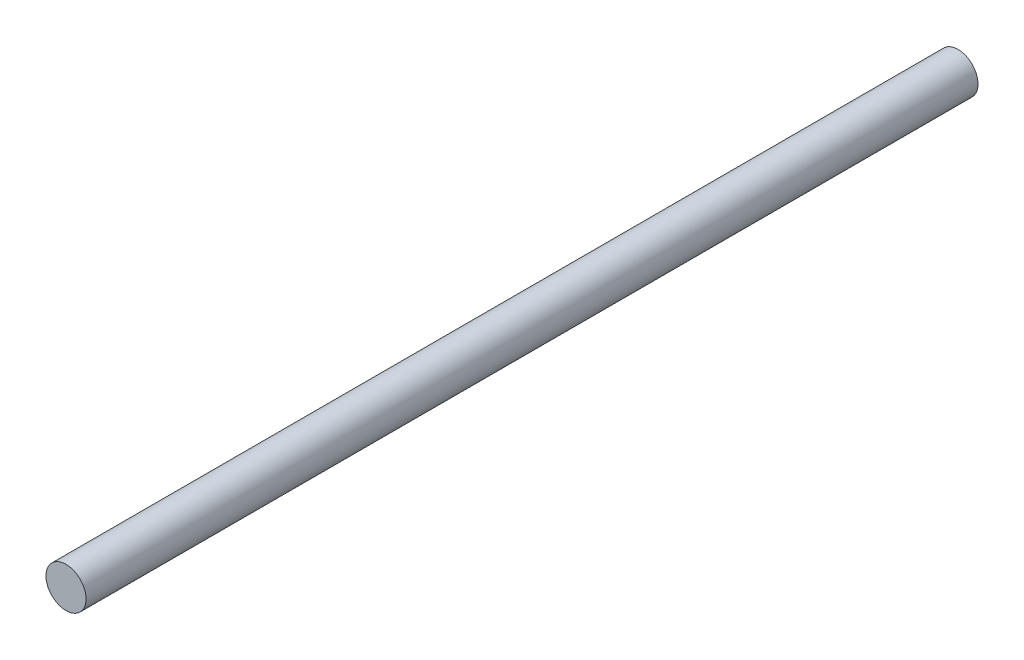
ISO-10303-21;
HEADER;
FILE_DESCRIPTION(('STEP AP214'),'2;1');
FILE_NAME('part.step','',(''),(''),'','','');
FILE_SCHEMA(('AUTOMOTIVE_DESIGN { 1 0 10303 214 1 1 1 1 }'));
ENDSEC;
DATA;
#1=APPLICATION_CONTEXT('core data for automotive mechanical design processes');
#2=APPLICATION_PROTOCOL_DEFINITION('international standard','automotive_design',2000,#1);
#3=PRODUCT_CONTEXT('',#1,'mechanical');
#4=PRODUCT('Part','Part','',(#3));
#5=PRODUCT_RELATED_PRODUCT_CATEGORY('part','',(#4));
#6=PRODUCT_DEFINITION_FORMATION('','',#4);
#7=PRODUCT_DEFINITION_CONTEXT('part definition',#1,'design');
#8=PRODUCT_DEFINITION('design','',#6,#7);
#9=PRODUCT_DEFINITION_SHAPE('','',#8);
#10=(LENGTH_UNIT() NAMED_UNIT(*) SI_UNIT(.MILLI.,.METRE.));
#11=(NAMED_UNIT(*) PLANE_ANGLE_UNIT() SI_UNIT($,.RADIAN.));
#12=(NAMED_UNIT(*) SI_UNIT($,.STERADIAN.) SOLID_ANGLE_UNIT());
#13=UNCERTAINTY_MEASURE_WITH_UNIT(LENGTH_MEASURE(1.E-05),#10,'distance_accuracy_value','');
#14=(GEOMETRIC_REPRESENTATION_CONTEXT(3) GLOBAL_UNCERTAINTY_ASSIGNED_CONTEXT((#13)) GLOBAL_UNIT_ASSIGNED_CONTEXT((#10,
#11,#12)) REPRESENTATION_CONTEXT('',''));
#15=CARTESIAN_POINT('',(0.,0.,0.));
#16=DIRECTION('',(0.,0.,1.));
#17=DIRECTION('',(1.,0.,0.));
#18=AXIS2_PLACEMENT_3D('',#15,#16,#17);
#19=CARTESIAN_POINT('',(0.,0.,66.76));
#20=DIRECTION('',(0.,0.,-1.));
#21=DIRECTION('',(-1.,0.,0.));
#22=AXIS2_PLACEMENT_3D('',#19,#20,#21);
#23=CYLINDRICAL_SURFACE('',#22,1.5);
#24=CARTESIAN_POINT('',(0.,0.,66.76));
#25=DIRECTION('',(0.,0.,1.));
#26=DIRECTION('',(1.,0.,0.));
#27=AXIS2_PLACEMENT_3D('',#24,#25,#26);
#28=CIRCLE('',#27,1.5);
#29=CARTESIAN_POINT('',(1.5,0.,66.76));
#30=VERTEX_POINT('',#29);
#31=EDGE_CURVE('E10',#30,#30,#28,.T.);
#32=ORIENTED_EDGE('',*,*,#31,.F.);
#33=EDGE_LOOP('',(#32));
#34=FACE_BOUND('',#33,.T.);
#35=CARTESIAN_POINT('',(0.,0.,0.));
#36=DIRECTION('',(0.,0.,1.));
#37=DIRECTION('',(1.,0.,0.));
#38=AXIS2_PLACEMENT_3D('',#35,#36,#37);
#39=CIRCLE('',#38,1.5);
#40=CARTESIAN_POINT('',(1.5,0.,0.));
#41=VERTEX_POINT('',#40);
#42=EDGE_CURVE('E17',#41,#41,#39,.T.);
#43=ORIENTED_EDGE('',*,*,#42,.T.);
#44=EDGE_LOOP('',(#43));
#45=FACE_BOUND('',#44,.T.);
#46=ADVANCED_FACE('F14',(#34,#45),#23,.T.);
#47=CARTESIAN_POINT('',(0.,0.,66.76));
#48=DIRECTION('',(0.,0.,1.));
#49=DIRECTION('',(1.,0.,0.));
#50=AXIS2_PLACEMENT_3D('',#47,#48,#49);
#51=PLANE('',#50);
#52=ORIENTED_EDGE('',*,*,#31,.T.);
#53=EDGE_LOOP('',(#52));
#54=FACE_BOUND('',#53,.T.);
#55=ADVANCED_FACE('F29',(#54),#51,.T.);
#56=CARTESIAN_POINT('',(0.,0.,0.));
#57=DIRECTION('',(0.,0.,1.));
#58=DIRECTION('',(1.,0.,0.));
#59=AXIS2_PLACEMENT_3D('',#56,#57,#58);
#60=PLANE('',#59);
#61=ORIENTED_EDGE('',*,*,#42,.F.);
#62=EDGE_LOOP('',(#61));
#63=FACE_BOUND('',#62,.T.);
#64=ADVANCED_FACE('F27',(#63),#60,.F.);
#65=CLOSED_SHELL('',(#46,#55,#64));
#66=MANIFOLD_SOLID_BREP('B1',#65);
#67=ADVANCED_BREP_SHAPE_REPRESENTATION('',(#18,#66),#14);
#68=SHAPE_DEFINITION_REPRESENTATION(#9,#67);
ENDSEC;
END-ISO-10303-21;
